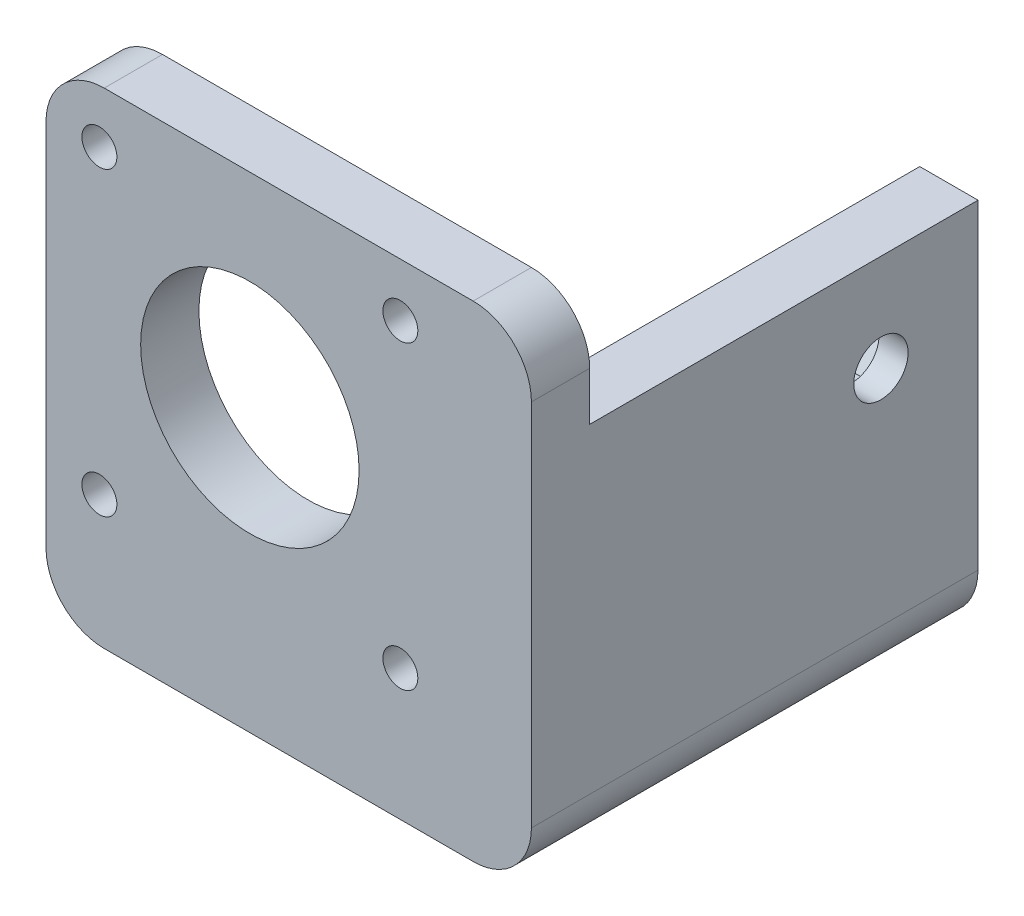
ISO-10303-21;
HEADER;
FILE_DESCRIPTION(('STEP AP214'),'2;1');
FILE_NAME('part.step','',(''),(''),'','','');
FILE_SCHEMA(('AUTOMOTIVE_DESIGN { 1 0 10303 214 1 1 1 1 }'));
ENDSEC;
DATA;
#1=APPLICATION_CONTEXT('core data for automotive mechanical design processes');
#2=APPLICATION_PROTOCOL_DEFINITION('international standard','automotive_design',2000,#1);
#3=PRODUCT_CONTEXT('',#1,'mechanical');
#4=PRODUCT('Part','Part','',(#3));
#5=PRODUCT_RELATED_PRODUCT_CATEGORY('part','',(#4));
#6=PRODUCT_DEFINITION_FORMATION('','',#4);
#7=PRODUCT_DEFINITION_CONTEXT('part definition',#1,'design');
#8=PRODUCT_DEFINITION('design','',#6,#7);
#9=PRODUCT_DEFINITION_SHAPE('','',#8);
#10=(LENGTH_UNIT() NAMED_UNIT(*) SI_UNIT(.MILLI.,.METRE.));
#11=(NAMED_UNIT(*) PLANE_ANGLE_UNIT() SI_UNIT($,.RADIAN.));
#12=(NAMED_UNIT(*) SI_UNIT($,.STERADIAN.) SOLID_ANGLE_UNIT());
#13=UNCERTAINTY_MEASURE_WITH_UNIT(LENGTH_MEASURE(1.E-05),#10,'distance_accuracy_value','');
#14=(GEOMETRIC_REPRESENTATION_CONTEXT(3) GLOBAL_UNCERTAINTY_ASSIGNED_CONTEXT((#13)) GLOBAL_UNIT_ASSIGNED_CONTEXT((#10,
#11,#12)) REPRESENTATION_CONTEXT('',''));
#15=CARTESIAN_POINT('',(0.,0.,0.));
#16=DIRECTION('',(0.,0.,1.));
#17=DIRECTION('',(1.,0.,0.));
#18=AXIS2_PLACEMENT_3D('',#15,#16,#17);
#19=CARTESIAN_POINT('',(0.,29.,-36.));
#20=DIRECTION('',(1.,0.,0.));
#21=DIRECTION('',(0.,0.,-1.));
#22=AXIS2_PLACEMENT_3D('',#19,#20,#21);
#23=CYLINDRICAL_SURFACE('',#22,2.79999999999999);
#24=CARTESIAN_POINT('',(0.,29.,-36.));
#25=DIRECTION('',(1.,0.,0.));
#26=DIRECTION('',(0.,0.,-1.));
#27=AXIS2_PLACEMENT_3D('',#24,#25,#26);
#28=CIRCLE('',#27,2.8);
#29=CARTESIAN_POINT('',(0.,29.,-38.8));
#30=VERTEX_POINT('',#29);
#31=EDGE_CURVE('E317',#30,#30,#28,.T.);
#32=ORIENTED_EDGE('',*,*,#31,.T.);
#33=EDGE_LOOP('',(#32));
#34=FACE_BOUND('',#33,.T.);
#35=CARTESIAN_POINT('',(-3.,29.,-36.));
#36=DIRECTION('',(-1.,0.,0.));
#37=DIRECTION('',(0.,0.,1.));
#38=AXIS2_PLACEMENT_3D('',#35,#36,#37);
#39=CIRCLE('',#38,2.79999999999999);
#40=CARTESIAN_POINT('',(-3.,29.,-33.2));
#41=VERTEX_POINT('',#40);
#42=EDGE_CURVE('E257',#41,#41,#39,.F.);
#43=ORIENTED_EDGE('',*,*,#42,.F.);
#44=EDGE_LOOP('',(#43));
#45=FACE_BOUND('',#44,.T.);
#46=ADVANCED_FACE('F37',(#34,#45),#23,.F.);
#47=CARTESIAN_POINT('',(-24.,0.,-15.));
#48=DIRECTION('',(0.,-1.,0.));
#49=DIRECTION('',(0.,0.,-1.));
#50=AXIS2_PLACEMENT_3D('',#47,#48,#49);
#51=CYLINDRICAL_SURFACE('',#50,2.79999999999999);
#52=CARTESIAN_POINT('',(-24.,0.,-15.));
#53=DIRECTION('',(0.,-1.,0.));
#54=DIRECTION('',(0.,0.,-1.));
#55=AXIS2_PLACEMENT_3D('',#52,#53,#54);
#56=CIRCLE('',#55,2.79999999999999);
#57=CARTESIAN_POINT('',(-24.,0.,-17.8));
#58=VERTEX_POINT('',#57);
#59=EDGE_CURVE('E314',#58,#58,#56,.T.);
#60=ORIENTED_EDGE('',*,*,#59,.T.);
#61=EDGE_LOOP('',(#60));
#62=FACE_BOUND('',#61,.T.);
#63=CARTESIAN_POINT('',(-24.,3.,-15.));
#64=DIRECTION('',(0.,1.,0.));
#65=DIRECTION('',(-1.,0.,0.));
#66=AXIS2_PLACEMENT_3D('',#63,#64,#65);
#67=CIRCLE('',#66,2.79999999999999);
#68=CARTESIAN_POINT('',(-26.8,3.,-15.));
#69=VERTEX_POINT('',#68);
#70=EDGE_CURVE('E303',#69,#69,#67,.F.);
#71=ORIENTED_EDGE('',*,*,#70,.F.);
#72=EDGE_LOOP('',(#71));
#73=FACE_BOUND('',#72,.T.);
#74=ADVANCED_FACE('F494',(#62,#73),#51,.F.);
#75=CARTESIAN_POINT('',(0.,0.,-6.));
#76=DIRECTION('',(0.,0.,1.));
#77=DIRECTION('',(1.,0.,0.));
#78=AXIS2_PLACEMENT_3D('',#75,#76,#77);
#79=PLANE('',#78);
#80=CARTESIAN_POINT('',(-29.,29.,-6.));
#81=DIRECTION('',(0.,0.,1.));
#82=DIRECTION('',(1.,0.,0.));
#83=AXIS2_PLACEMENT_3D('',#80,#81,#82);
#84=CIRCLE('',#83,11.25);
#85=CARTESIAN_POINT('',(-17.75,29.,-6.));
#86=VERTEX_POINT('',#85);
#87=EDGE_CURVE('E323',#86,#86,#84,.T.);
#88=ORIENTED_EDGE('',*,*,#87,.T.);
#89=EDGE_LOOP('',(#88));
#90=FACE_BOUND('',#89,.T.);
#91=CARTESIAN_POINT('',(-44.5,44.5,-6.));
#92=DIRECTION('',(0.,0.,1.));
#93=DIRECTION('',(1.,0.,0.));
#94=AXIS2_PLACEMENT_3D('',#91,#92,#93);
#95=CIRCLE('',#94,1.8);
#96=CARTESIAN_POINT('',(-42.7,44.5,-6.));
#97=VERTEX_POINT('',#96);
#98=EDGE_CURVE('E329',#97,#97,#95,.T.);
#99=ORIENTED_EDGE('',*,*,#98,.T.);
#100=EDGE_LOOP('',(#99));
#101=FACE_BOUND('',#100,.T.);
#102=CARTESIAN_POINT('',(-13.5,44.5,-6.));
#103=DIRECTION('',(0.,0.,1.));
#104=DIRECTION('',(1.,0.,0.));
#105=AXIS2_PLACEMENT_3D('',#102,#103,#104);
#106=CIRCLE('',#105,1.8);
#107=CARTESIAN_POINT('',(-11.7,44.5,-6.));
#108=VERTEX_POINT('',#107);
#109=EDGE_CURVE('E335',#108,#108,#106,.T.);
#110=ORIENTED_EDGE('',*,*,#109,.T.);
#111=EDGE_LOOP('',(#110));
#112=FACE_BOUND('',#111,.T.);
#113=CARTESIAN_POINT('',(-13.5,13.5,-6.));
#114=DIRECTION('',(0.,0.,1.));
#115=DIRECTION('',(1.,0.,0.));
#116=AXIS2_PLACEMENT_3D('',#113,#114,#115);
#117=CIRCLE('',#116,1.8);
#118=CARTESIAN_POINT('',(-11.7,13.5,-6.));
#119=VERTEX_POINT('',#118);
#120=EDGE_CURVE('E339',#119,#119,#117,.T.);
#121=ORIENTED_EDGE('',*,*,#120,.T.);
#122=EDGE_LOOP('',(#121));
#123=FACE_BOUND('',#122,.T.);
#124=CARTESIAN_POINT('',(-44.5,13.5,-6.));
#125=DIRECTION('',(0.,0.,1.));
#126=DIRECTION('',(1.,0.,0.));
#127=AXIS2_PLACEMENT_3D('',#124,#125,#126);
#128=CIRCLE('',#127,1.8);
#129=CARTESIAN_POINT('',(-42.7,13.5,-6.));
#130=VERTEX_POINT('',#129);
#131=EDGE_CURVE('E345',#130,#130,#128,.T.);
#132=ORIENTED_EDGE('',*,*,#131,.T.);
#133=EDGE_LOOP('',(#132));
#134=FACE_BOUND('',#133,.T.);
#135=DIRECTION('',(1.,0.,0.));
#136=VECTOR('',#135,1.);
#137=CARTESIAN_POINT('',(-50.,0.,-6.));
#138=LINE('',#137,#136);
#139=CARTESIAN_POINT('',(-44.,0.,-6.));
#140=VERTEX_POINT('',#139);
#141=CARTESIAN_POINT('',(-34.,0.,-6.));
#142=VERTEX_POINT('',#141);
#143=EDGE_CURVE('E389',#140,#142,#138,.T.);
#144=ORIENTED_EDGE('',*,*,#143,.F.);
#145=CARTESIAN_POINT('',(-44.,6.,-6.));
#146=DIRECTION('',(0.,0.,1.));
#147=DIRECTION('',(1.,0.,0.));
#148=AXIS2_PLACEMENT_3D('',#145,#146,#147);
#149=CIRCLE('',#148,6.);
#150=CARTESIAN_POINT('',(-50.,6.,-6.));
#151=VERTEX_POINT('',#150);
#152=EDGE_CURVE('E436',#140,#151,#149,.F.);
#153=ORIENTED_EDGE('',*,*,#152,.T.);
#154=DIRECTION('',(0.,-1.,0.));
#155=VECTOR('',#154,1.);
#156=CARTESIAN_POINT('',(-50.,50.,-6.));
#157=LINE('',#156,#155);
#158=CARTESIAN_POINT('',(-50.,44.,-6.));
#159=VERTEX_POINT('',#158);
#160=EDGE_CURVE('E386',#159,#151,#157,.T.);
#161=ORIENTED_EDGE('',*,*,#160,.F.);
#162=CARTESIAN_POINT('',(-44.,44.,-6.));
#163=DIRECTION('',(0.,0.,1.));
#164=DIRECTION('',(1.,0.,0.));
#165=AXIS2_PLACEMENT_3D('',#162,#163,#164);
#166=CIRCLE('',#165,6.);
#167=CARTESIAN_POINT('',(-44.,50.,-6.));
#168=VERTEX_POINT('',#167);
#169=EDGE_CURVE('E434',#159,#168,#166,.F.);
#170=ORIENTED_EDGE('',*,*,#169,.T.);
#171=DIRECTION('',(-1.,0.,0.));
#172=VECTOR('',#171,1.);
#173=CARTESIAN_POINT('',(-50.,50.,-6.));
#174=LINE('',#173,#172);
#175=CARTESIAN_POINT('',(-6.,50.,-6.));
#176=VERTEX_POINT('',#175);
#177=EDGE_CURVE('E394',#176,#168,#174,.T.);
#178=ORIENTED_EDGE('',*,*,#177,.F.);
#179=CARTESIAN_POINT('',(-6.,44.,-6.));
#180=DIRECTION('',(0.,0.,1.));
#181=DIRECTION('',(1.,0.,0.));
#182=AXIS2_PLACEMENT_3D('',#179,#180,#181);
#183=CIRCLE('',#182,6.);
#184=CARTESIAN_POINT('',(0.,44.,-6.));
#185=VERTEX_POINT('',#184);
#186=EDGE_CURVE('E59',#176,#185,#183,.F.);
#187=ORIENTED_EDGE('',*,*,#186,.T.);
#188=DIRECTION('',(0.,1.,0.));
#189=VECTOR('',#188,1.);
#190=CARTESIAN_POINT('',(0.,50.,-6.));
#191=LINE('',#190,#189);
#192=CARTESIAN_POINT('',(0.,39.,-6.));
#193=VERTEX_POINT('',#192);
#194=EDGE_CURVE('E392',#193,#185,#191,.T.);
#195=ORIENTED_EDGE('',*,*,#194,.F.);
#196=DIRECTION('',(1.,0.,0.));
#197=VECTOR('',#196,1.);
#198=CARTESIAN_POINT('',(0.,39.,-6.));
#199=LINE('',#198,#197);
#200=CARTESIAN_POINT('',(-6.,39.,-6.));
#201=VERTEX_POINT('',#200);
#202=EDGE_CURVE('E349',#201,#193,#199,.T.);
#203=ORIENTED_EDGE('',*,*,#202,.F.);
#204=DIRECTION('',(0.,1.,0.));
#205=VECTOR('',#204,1.);
#206=CARTESIAN_POINT('',(-6.,39.,-6.));
#207=LINE('',#206,#205);
#208=CARTESIAN_POINT('',(-6.,6.,-6.));
#209=VERTEX_POINT('',#208);
#210=EDGE_CURVE('E366',#209,#201,#207,.T.);
#211=ORIENTED_EDGE('',*,*,#210,.F.);
#212=DIRECTION('',(1.,0.,0.));
#213=VECTOR('',#212,1.);
#214=CARTESIAN_POINT('',(-6.,6.,-6.));
#215=LINE('',#214,#213);
#216=CARTESIAN_POINT('',(-34.,6.,-6.));
#217=VERTEX_POINT('',#216);
#218=EDGE_CURVE('E363',#217,#209,#215,.T.);
#219=ORIENTED_EDGE('',*,*,#218,.F.);
#220=DIRECTION('',(0.,1.,0.));
#221=VECTOR('',#220,1.);
#222=CARTESIAN_POINT('',(-34.,6.,-6.));
#223=LINE('',#222,#221);
#224=EDGE_CURVE('E360',#142,#217,#223,.T.);
#225=ORIENTED_EDGE('',*,*,#224,.F.);
#226=EDGE_LOOP('',(#144,#153,#161,#170,#178,#187,#195,#203,#211,#219,#225));
#227=FACE_BOUND('',#226,.T.);
#228=ADVANCED_FACE('F471',(#90,#101,#112,#123,#134,#227),#79,.F.);
#229=CARTESIAN_POINT('',(-50.,50.,-6.));
#230=DIRECTION('',(-1.,0.,0.));
#231=DIRECTION('',(0.,0.,1.));
#232=AXIS2_PLACEMENT_3D('',#229,#230,#231);
#233=PLANE('',#232);
#234=ORIENTED_EDGE('',*,*,#160,.T.);
#235=DIRECTION('',(0.,0.,1.));
#236=VECTOR('',#235,1.);
#237=CARTESIAN_POINT('',(-50.,6.,-6.));
#238=LINE('',#237,#236);
#239=CARTESIAN_POINT('',(-50.,6.,0.));
#240=VERTEX_POINT('',#239);
#241=EDGE_CURVE('E417',#151,#240,#238,.T.);
#242=ORIENTED_EDGE('',*,*,#241,.T.);
#243=DIRECTION('',(0.,-1.,0.));
#244=VECTOR('',#243,1.);
#245=CARTESIAN_POINT('',(-50.,50.,0.));
#246=LINE('',#245,#244);
#247=CARTESIAN_POINT('',(-50.,44.,0.));
#248=VERTEX_POINT('',#247);
#249=EDGE_CURVE('E385',#248,#240,#246,.T.);
#250=ORIENTED_EDGE('',*,*,#249,.F.);
#251=DIRECTION('',(0.,0.,1.));
#252=VECTOR('',#251,1.);
#253=CARTESIAN_POINT('',(-50.,44.,-6.));
#254=LINE('',#253,#252);
#255=EDGE_CURVE('E397',#248,#159,#254,.F.);
#256=ORIENTED_EDGE('',*,*,#255,.T.);
#257=EDGE_LOOP('',(#234,#242,#250,#256));
#258=FACE_BOUND('',#257,.T.);
#259=ADVANCED_FACE('F677',(#258),#233,.T.);
#260=CARTESIAN_POINT('',(-50.,50.,-6.));
#261=DIRECTION('',(0.,1.,0.));
#262=DIRECTION('',(0.,0.,1.));
#263=AXIS2_PLACEMENT_3D('',#260,#261,#262);
#264=PLANE('',#263);
#265=ORIENTED_EDGE('',*,*,#177,.T.);
#266=DIRECTION('',(0.,0.,1.));
#267=VECTOR('',#266,1.);
#268=CARTESIAN_POINT('',(-44.,50.,-6.));
#269=LINE('',#268,#267);
#270=CARTESIAN_POINT('',(-44.,50.,0.));
#271=VERTEX_POINT('',#270);
#272=EDGE_CURVE('E440',#168,#271,#269,.T.);
#273=ORIENTED_EDGE('',*,*,#272,.T.);
#274=DIRECTION('',(-1.,0.,0.));
#275=VECTOR('',#274,1.);
#276=CARTESIAN_POINT('',(-50.,50.,0.));
#277=LINE('',#276,#275);
#278=CARTESIAN_POINT('',(-6.,50.,0.));
#279=VERTEX_POINT('',#278);
#280=EDGE_CURVE('E390',#279,#271,#277,.T.);
#281=ORIENTED_EDGE('',*,*,#280,.F.);
#282=DIRECTION('',(0.,0.,1.));
#283=VECTOR('',#282,1.);
#284=CARTESIAN_POINT('',(-6.,50.,-6.));
#285=LINE('',#284,#283);
#286=EDGE_CURVE('E438',#279,#176,#285,.F.);
#287=ORIENTED_EDGE('',*,*,#286,.T.);
#288=EDGE_LOOP('',(#265,#273,#281,#287));
#289=FACE_BOUND('',#288,.T.);
#290=ADVANCED_FACE('F688',(#289),#264,.T.);
#291=CARTESIAN_POINT('',(0.,50.,-6.));
#292=DIRECTION('',(1.,0.,0.));
#293=DIRECTION('',(0.,0.,-1.));
#294=AXIS2_PLACEMENT_3D('',#291,#292,#293);
#295=PLANE('',#294);
#296=ORIENTED_EDGE('',*,*,#31,.F.);
#297=EDGE_LOOP('',(#296));
#298=FACE_BOUND('',#297,.T.);
#299=DIRECTION('',(0.,1.,0.));
#300=VECTOR('',#299,1.);
#301=CARTESIAN_POINT('',(0.,50.,0.));
#302=LINE('',#301,#300);
#303=CARTESIAN_POINT('',(0.,6.,0.));
#304=VERTEX_POINT('',#303);
#305=CARTESIAN_POINT('',(0.,44.,0.));
#306=VERTEX_POINT('',#305);
#307=EDGE_CURVE('E403',#304,#306,#302,.T.);
#308=ORIENTED_EDGE('',*,*,#307,.F.);
#309=DIRECTION('',(0.,0.,1.));
#310=VECTOR('',#309,1.);
#311=CARTESIAN_POINT('',(0.,6.,-6.));
#312=LINE('',#311,#310);
#313=CARTESIAN_POINT('',(0.,6.,-46.));
#314=VERTEX_POINT('',#313);
#315=EDGE_CURVE('E45',#304,#314,#312,.F.);
#316=ORIENTED_EDGE('',*,*,#315,.T.);
#317=DIRECTION('',(0.,-1.,0.));
#318=VECTOR('',#317,1.);
#319=CARTESIAN_POINT('',(0.,39.,-46.));
#320=LINE('',#319,#318);
#321=CARTESIAN_POINT('',(0.,39.,-46.));
#322=VERTEX_POINT('',#321);
#323=EDGE_CURVE('E346',#322,#314,#320,.T.);
#324=ORIENTED_EDGE('',*,*,#323,.F.);
#325=DIRECTION('',(0.,0.,1.));
#326=VECTOR('',#325,1.);
#327=CARTESIAN_POINT('',(0.,39.,-46.));
#328=LINE('',#327,#326);
#329=EDGE_CURVE('E359',#322,#193,#328,.T.);
#330=ORIENTED_EDGE('',*,*,#329,.T.);
#331=ORIENTED_EDGE('',*,*,#194,.T.);
#332=DIRECTION('',(0.,0.,1.));
#333=VECTOR('',#332,1.);
#334=CARTESIAN_POINT('',(0.,44.,-6.));
#335=LINE('',#334,#333);
#336=EDGE_CURVE('E443',#185,#306,#335,.T.);
#337=ORIENTED_EDGE('',*,*,#336,.T.);
#338=EDGE_LOOP('',(#308,#316,#324,#330,#331,#337));
#339=FACE_BOUND('',#338,.T.);
#340=ADVANCED_FACE('F446',(#298,#339),#295,.T.);
#341=CARTESIAN_POINT('',(-50.,0.,-6.));
#342=DIRECTION('',(0.,-1.,0.));
#343=DIRECTION('',(0.,0.,-1.));
#344=AXIS2_PLACEMENT_3D('',#341,#342,#343);
#345=PLANE('',#344);
#346=ORIENTED_EDGE('',*,*,#59,.F.);
#347=EDGE_LOOP('',(#346));
#348=FACE_BOUND('',#347,.T.);
#349=DIRECTION('',(1.,0.,0.));
#350=VECTOR('',#349,1.);
#351=CARTESIAN_POINT('',(-50.,0.,0.));
#352=LINE('',#351,#350);
#353=CARTESIAN_POINT('',(-44.,0.,0.));
#354=VERTEX_POINT('',#353);
#355=CARTESIAN_POINT('',(-6.,0.,0.));
#356=VERTEX_POINT('',#355);
#357=EDGE_CURVE('E400',#354,#356,#352,.T.);
#358=ORIENTED_EDGE('',*,*,#357,.F.);
#359=DIRECTION('',(0.,0.,1.));
#360=VECTOR('',#359,1.);
#361=CARTESIAN_POINT('',(-44.,0.,-6.));
#362=LINE('',#361,#360);
#363=EDGE_CURVE('E431',#354,#140,#362,.F.);
#364=ORIENTED_EDGE('',*,*,#363,.T.);
#365=ORIENTED_EDGE('',*,*,#143,.T.);
#366=DIRECTION('',(0.,0.,1.));
#367=VECTOR('',#366,1.);
#368=CARTESIAN_POINT('',(-34.,0.,-46.));
#369=LINE('',#368,#367);
#370=CARTESIAN_POINT('',(-34.,0.,-46.));
#371=VERTEX_POINT('',#370);
#372=EDGE_CURVE('E382',#371,#142,#369,.T.);
#373=ORIENTED_EDGE('',*,*,#372,.F.);
#374=DIRECTION('',(-1.,0.,0.));
#375=VECTOR('',#374,1.);
#376=CARTESIAN_POINT('',(0.,0.,-46.));
#377=LINE('',#376,#375);
#378=CARTESIAN_POINT('',(-6.,0.,-46.));
#379=VERTEX_POINT('',#378);
#380=EDGE_CURVE('E348',#379,#371,#377,.T.);
#381=ORIENTED_EDGE('',*,*,#380,.F.);
#382=DIRECTION('',(0.,0.,1.));
#383=VECTOR('',#382,1.);
#384=CARTESIAN_POINT('',(-6.,0.,-6.));
#385=LINE('',#384,#383);
#386=EDGE_CURVE('E428',#379,#356,#385,.T.);
#387=ORIENTED_EDGE('',*,*,#386,.T.);
#388=EDGE_LOOP('',(#358,#364,#365,#373,#381,#387));
#389=FACE_BOUND('',#388,.T.);
#390=ADVANCED_FACE('F458',(#348,#389),#345,.T.);
#391=CARTESIAN_POINT('',(0.,0.,0.));
#392=DIRECTION('',(0.,0.,1.));
#393=DIRECTION('',(1.,0.,0.));
#394=AXIS2_PLACEMENT_3D('',#391,#392,#393);
#395=PLANE('',#394);
#396=CARTESIAN_POINT('',(-29.,29.,0.));
#397=DIRECTION('',(0.,0.,1.));
#398=DIRECTION('',(1.,0.,0.));
#399=AXIS2_PLACEMENT_3D('',#396,#397,#398);
#400=CIRCLE('',#399,11.25);
#401=CARTESIAN_POINT('',(-17.75,29.,0.));
#402=VERTEX_POINT('',#401);
#403=EDGE_CURVE('E320',#402,#402,#400,.T.);
#404=ORIENTED_EDGE('',*,*,#403,.F.);
#405=EDGE_LOOP('',(#404));
#406=FACE_BOUND('',#405,.T.);
#407=CARTESIAN_POINT('',(-44.5,44.5,0.));
#408=DIRECTION('',(0.,0.,1.));
#409=DIRECTION('',(1.,0.,0.));
#410=AXIS2_PLACEMENT_3D('',#407,#408,#409);
#411=CIRCLE('',#410,1.8);
#412=CARTESIAN_POINT('',(-42.7,44.5,0.));
#413=VERTEX_POINT('',#412);
#414=EDGE_CURVE('E326',#413,#413,#411,.T.);
#415=ORIENTED_EDGE('',*,*,#414,.F.);
#416=EDGE_LOOP('',(#415));
#417=FACE_BOUND('',#416,.T.);
#418=CARTESIAN_POINT('',(-13.5,44.5,0.));
#419=DIRECTION('',(0.,0.,1.));
#420=DIRECTION('',(1.,0.,0.));
#421=AXIS2_PLACEMENT_3D('',#418,#419,#420);
#422=CIRCLE('',#421,1.8);
#423=CARTESIAN_POINT('',(-11.7,44.5,0.));
#424=VERTEX_POINT('',#423);
#425=EDGE_CURVE('E332',#424,#424,#422,.T.);
#426=ORIENTED_EDGE('',*,*,#425,.F.);
#427=EDGE_LOOP('',(#426));
#428=FACE_BOUND('',#427,.T.);
#429=CARTESIAN_POINT('',(-13.5,13.5,0.));
#430=DIRECTION('',(0.,0.,1.));
#431=DIRECTION('',(1.,0.,0.));
#432=AXIS2_PLACEMENT_3D('',#429,#430,#431);
#433=CIRCLE('',#432,1.8);
#434=CARTESIAN_POINT('',(-11.7,13.5,0.));
#435=VERTEX_POINT('',#434);
#436=EDGE_CURVE('E336',#435,#435,#433,.T.);
#437=ORIENTED_EDGE('',*,*,#436,.F.);
#438=EDGE_LOOP('',(#437));
#439=FACE_BOUND('',#438,.T.);
#440=CARTESIAN_POINT('',(-44.5,13.5,0.));
#441=DIRECTION('',(0.,0.,1.));
#442=DIRECTION('',(1.,0.,0.));
#443=AXIS2_PLACEMENT_3D('',#440,#441,#442);
#444=CIRCLE('',#443,1.8);
#445=CARTESIAN_POINT('',(-42.7,13.5,0.));
#446=VERTEX_POINT('',#445);
#447=EDGE_CURVE('E342',#446,#446,#444,.T.);
#448=ORIENTED_EDGE('',*,*,#447,.F.);
#449=EDGE_LOOP('',(#448));
#450=FACE_BOUND('',#449,.T.);
#451=ORIENTED_EDGE('',*,*,#249,.T.);
#452=CARTESIAN_POINT('',(-44.,6.,0.));
#453=DIRECTION('',(0.,0.,1.));
#454=DIRECTION('',(1.,0.,0.));
#455=AXIS2_PLACEMENT_3D('',#452,#453,#454);
#456=CIRCLE('',#455,6.);
#457=EDGE_CURVE('E426',#240,#354,#456,.T.);
#458=ORIENTED_EDGE('',*,*,#457,.T.);
#459=ORIENTED_EDGE('',*,*,#357,.T.);
#460=CARTESIAN_POINT('',(-6.,6.,0.));
#461=DIRECTION('',(0.,0.,1.));
#462=DIRECTION('',(1.,0.,0.));
#463=AXIS2_PLACEMENT_3D('',#460,#461,#462);
#464=CIRCLE('',#463,6.);
#465=EDGE_CURVE('E422',#356,#304,#464,.T.);
#466=ORIENTED_EDGE('',*,*,#465,.T.);
#467=ORIENTED_EDGE('',*,*,#307,.T.);
#468=CARTESIAN_POINT('',(-6.,44.,0.));
#469=DIRECTION('',(0.,0.,1.));
#470=DIRECTION('',(1.,0.,0.));
#471=AXIS2_PLACEMENT_3D('',#468,#469,#470);
#472=CIRCLE('',#471,6.);
#473=EDGE_CURVE('E420',#306,#279,#472,.T.);
#474=ORIENTED_EDGE('',*,*,#473,.T.);
#475=ORIENTED_EDGE('',*,*,#280,.T.);
#476=CARTESIAN_POINT('',(-44.,44.,0.));
#477=DIRECTION('',(0.,0.,1.));
#478=DIRECTION('',(1.,0.,0.));
#479=AXIS2_PLACEMENT_3D('',#476,#477,#478);
#480=CIRCLE('',#479,6.);
#481=EDGE_CURVE('E424',#271,#248,#480,.T.);
#482=ORIENTED_EDGE('',*,*,#481,.T.);
#483=EDGE_LOOP('',(#451,#458,#459,#466,#467,#474,#475,#482));
#484=FACE_BOUND('',#483,.T.);
#485=ADVANCED_FACE('F449',(#406,#417,#428,#439,#450,#484),#395,.T.);
#486=CARTESIAN_POINT('',(-34.,6.,-46.));
#487=DIRECTION('',(1.,0.,0.));
#488=DIRECTION('',(0.,0.,-1.));
#489=AXIS2_PLACEMENT_3D('',#486,#487,#488);
#490=PLANE('',#489);
#491=ORIENTED_EDGE('',*,*,#224,.T.);
#492=DIRECTION('',(0.,0.,1.));
#493=VECTOR('',#492,1.);
#494=CARTESIAN_POINT('',(-34.,6.,-46.));
#495=LINE('',#494,#493);
#496=CARTESIAN_POINT('',(-34.,6.,-46.));
#497=VERTEX_POINT('',#496);
#498=EDGE_CURVE('E379',#497,#217,#495,.T.);
#499=ORIENTED_EDGE('',*,*,#498,.F.);
#500=DIRECTION('',(0.,1.,0.));
#501=VECTOR('',#500,1.);
#502=CARTESIAN_POINT('',(-34.,6.,-46.));
#503=LINE('',#502,#501);
#504=EDGE_CURVE('E351',#371,#497,#503,.T.);
#505=ORIENTED_EDGE('',*,*,#504,.F.);
#506=ORIENTED_EDGE('',*,*,#372,.T.);
#507=EDGE_LOOP('',(#491,#499,#505,#506));
#508=FACE_BOUND('',#507,.T.);
#509=ADVANCED_FACE('F481',(#508),#490,.F.);
#510=CARTESIAN_POINT('',(-6.,6.,-46.));
#511=DIRECTION('',(0.,-1.,0.));
#512=DIRECTION('',(1.,0.,0.));
#513=AXIS2_PLACEMENT_3D('',#510,#511,#512);
#514=PLANE('',#513);
#515=DIRECTION('',(0.866025403784439,0.,0.499999999999999));
#516=VECTOR('',#515,1.);
#517=CARTESIAN_POINT('',(-28.2,6.,-12.5751288694036));
#518=LINE('',#517,#516);
#519=CARTESIAN_POINT('',(-28.2,6.,-12.5751288694036));
#520=VERTEX_POINT('',#519);
#521=CARTESIAN_POINT('',(-24.,6.,-10.1502577388071));
#522=VERTEX_POINT('',#521);
#523=EDGE_CURVE('E287',#520,#522,#518,.T.);
#524=ORIENTED_EDGE('',*,*,#523,.F.);
#525=DIRECTION('',(0.,0.,1.));
#526=VECTOR('',#525,1.);
#527=CARTESIAN_POINT('',(-28.2,6.,-17.4248711305964));
#528=LINE('',#527,#526);
#529=CARTESIAN_POINT('',(-28.2,6.,-17.4248711305964));
#530=VERTEX_POINT('',#529);
#531=EDGE_CURVE('E285',#530,#520,#528,.T.);
#532=ORIENTED_EDGE('',*,*,#531,.F.);
#533=DIRECTION('',(-0.866025403784439,0.,0.499999999999999));
#534=VECTOR('',#533,1.);
#535=CARTESIAN_POINT('',(-24.,6.,-19.8497422611929));
#536=LINE('',#535,#534);
#537=CARTESIAN_POINT('',(-24.,6.,-19.8497422611929));
#538=VERTEX_POINT('',#537);
#539=EDGE_CURVE('E269',#538,#530,#536,.T.);
#540=ORIENTED_EDGE('',*,*,#539,.F.);
#541=DIRECTION('',(-0.866025403784438,0.,-0.500000000000001));
#542=VECTOR('',#541,1.);
#543=CARTESIAN_POINT('',(-19.8,6.,-17.4248711305964));
#544=LINE('',#543,#542);
#545=CARTESIAN_POINT('',(-19.8,6.,-17.4248711305964));
#546=VERTEX_POINT('',#545);
#547=EDGE_CURVE('E296',#546,#538,#544,.T.);
#548=ORIENTED_EDGE('',*,*,#547,.F.);
#549=DIRECTION('',(0.,0.,-1.));
#550=VECTOR('',#549,1.);
#551=CARTESIAN_POINT('',(-19.8,6.,-12.5751288694036));
#552=LINE('',#551,#550);
#553=CARTESIAN_POINT('',(-19.8,6.,-12.5751288694036));
#554=VERTEX_POINT('',#553);
#555=EDGE_CURVE('E293',#554,#546,#552,.T.);
#556=ORIENTED_EDGE('',*,*,#555,.F.);
#557=DIRECTION('',(0.866025403784438,0.,-0.500000000000001));
#558=VECTOR('',#557,1.);
#559=CARTESIAN_POINT('',(-24.,6.,-10.1502577388071));
#560=LINE('',#559,#558);
#561=EDGE_CURVE('E290',#522,#554,#560,.T.);
#562=ORIENTED_EDGE('',*,*,#561,.F.);
#563=EDGE_LOOP('',(#524,#532,#540,#548,#556,#562));
#564=FACE_BOUND('',#563,.T.);
#565=ORIENTED_EDGE('',*,*,#218,.T.);
#566=DIRECTION('',(0.,0.,1.));
#567=VECTOR('',#566,1.);
#568=CARTESIAN_POINT('',(-6.,6.,-46.));
#569=LINE('',#568,#567);
#570=CARTESIAN_POINT('',(-6.,6.,-46.));
#571=VERTEX_POINT('',#570);
#572=EDGE_CURVE('E376',#571,#209,#569,.T.);
#573=ORIENTED_EDGE('',*,*,#572,.F.);
#574=DIRECTION('',(1.,0.,0.));
#575=VECTOR('',#574,1.);
#576=CARTESIAN_POINT('',(-6.,6.,-46.));
#577=LINE('',#576,#575);
#578=EDGE_CURVE('E353',#497,#571,#577,.T.);
#579=ORIENTED_EDGE('',*,*,#578,.F.);
#580=ORIENTED_EDGE('',*,*,#498,.T.);
#581=EDGE_LOOP('',(#565,#573,#579,#580));
#582=FACE_BOUND('',#581,.T.);
#583=ADVANCED_FACE('F478',(#564,#582),#514,.F.);
#584=CARTESIAN_POINT('',(-6.,39.,-46.));
#585=DIRECTION('',(1.,0.,0.));
#586=DIRECTION('',(0.,1.,0.));
#587=AXIS2_PLACEMENT_3D('',#584,#585,#586);
#588=PLANE('',#587);
#589=DIRECTION('',(0.,-0.866025403784438,0.5));
#590=VECTOR('',#589,1.);
#591=CARTESIAN_POINT('',(-6.,29.,-40.8497422611928));
#592=LINE('',#591,#590);
#593=CARTESIAN_POINT('',(-6.,29.,-40.8497422611928));
#594=VERTEX_POINT('',#593);
#595=CARTESIAN_POINT('',(-6.,24.8,-38.4248711305964));
#596=VERTEX_POINT('',#595);
#597=EDGE_CURVE('E245',#594,#596,#592,.T.);
#598=ORIENTED_EDGE('',*,*,#597,.F.);
#599=DIRECTION('',(0.,-0.86602540378444,-0.499999999999998));
#600=VECTOR('',#599,1.);
#601=CARTESIAN_POINT('',(-6.,33.2,-38.4248711305964));
#602=LINE('',#601,#600);
#603=CARTESIAN_POINT('',(-6.,33.2,-38.4248711305964));
#604=VERTEX_POINT('',#603);
#605=EDGE_CURVE('E212',#604,#594,#602,.T.);
#606=ORIENTED_EDGE('',*,*,#605,.F.);
#607=DIRECTION('',(0.,0.,-1.));
#608=VECTOR('',#607,1.);
#609=CARTESIAN_POINT('',(-6.,33.2,-33.5751288694036));
#610=LINE('',#609,#608);
#611=CARTESIAN_POINT('',(-6.,33.2,-33.5751288694036));
#612=VERTEX_POINT('',#611);
#613=EDGE_CURVE('E231',#612,#604,#610,.T.);
#614=ORIENTED_EDGE('',*,*,#613,.F.);
#615=DIRECTION('',(0.,0.866025403784438,-0.500000000000001));
#616=VECTOR('',#615,1.);
#617=CARTESIAN_POINT('',(-6.,29.,-31.1502577388071));
#618=LINE('',#617,#616);
#619=CARTESIAN_POINT('',(-6.,29.,-31.1502577388071));
#620=VERTEX_POINT('',#619);
#621=EDGE_CURVE('E234',#620,#612,#618,.T.);
#622=ORIENTED_EDGE('',*,*,#621,.F.);
#623=DIRECTION('',(0.,0.866025403784439,0.5));
#624=VECTOR('',#623,1.);
#625=CARTESIAN_POINT('',(-6.,24.8,-33.5751288694036));
#626=LINE('',#625,#624);
#627=CARTESIAN_POINT('',(-6.,24.8,-33.5751288694036));
#628=VERTEX_POINT('',#627);
#629=EDGE_CURVE('E250',#628,#620,#626,.T.);
#630=ORIENTED_EDGE('',*,*,#629,.F.);
#631=DIRECTION('',(0.,0.,1.));
#632=VECTOR('',#631,1.);
#633=CARTESIAN_POINT('',(-6.,24.8,-38.4248711305964));
#634=LINE('',#633,#632);
#635=EDGE_CURVE('E247',#596,#628,#634,.T.);
#636=ORIENTED_EDGE('',*,*,#635,.F.);
#637=EDGE_LOOP('',(#598,#606,#614,#622,#630,#636));
#638=FACE_BOUND('',#637,.T.);
#639=ORIENTED_EDGE('',*,*,#210,.T.);
#640=DIRECTION('',(0.,0.,1.));
#641=VECTOR('',#640,1.);
#642=CARTESIAN_POINT('',(-6.,39.,-46.));
#643=LINE('',#642,#641);
#644=CARTESIAN_POINT('',(-6.,39.,-46.));
#645=VERTEX_POINT('',#644);
#646=EDGE_CURVE('E373',#645,#201,#643,.T.);
#647=ORIENTED_EDGE('',*,*,#646,.F.);
#648=DIRECTION('',(0.,1.,0.));
#649=VECTOR('',#648,1.);
#650=CARTESIAN_POINT('',(-6.,39.,-46.));
#651=LINE('',#650,#649);
#652=EDGE_CURVE('E355',#571,#645,#651,.T.);
#653=ORIENTED_EDGE('',*,*,#652,.F.);
#654=ORIENTED_EDGE('',*,*,#572,.T.);
#655=EDGE_LOOP('',(#639,#647,#653,#654));
#656=FACE_BOUND('',#655,.T.);
#657=ADVANCED_FACE('F473',(#638,#656),#588,.F.);
#658=CARTESIAN_POINT('',(0.,39.,-46.));
#659=DIRECTION('',(0.,-1.,0.));
#660=DIRECTION('',(0.,0.,-1.));
#661=AXIS2_PLACEMENT_3D('',#658,#659,#660);
#662=PLANE('',#661);
#663=ORIENTED_EDGE('',*,*,#202,.T.);
#664=ORIENTED_EDGE('',*,*,#329,.F.);
#665=DIRECTION('',(1.,0.,0.));
#666=VECTOR('',#665,1.);
#667=CARTESIAN_POINT('',(0.,39.,-46.));
#668=LINE('',#667,#666);
#669=EDGE_CURVE('E357',#645,#322,#668,.T.);
#670=ORIENTED_EDGE('',*,*,#669,.F.);
#671=ORIENTED_EDGE('',*,*,#646,.T.);
#672=EDGE_LOOP('',(#663,#664,#670,#671));
#673=FACE_BOUND('',#672,.T.);
#674=ADVANCED_FACE('F468',(#673),#662,.F.);
#675=CARTESIAN_POINT('',(0.,0.,-46.));
#676=DIRECTION('',(0.,0.,-1.));
#677=DIRECTION('',(-1.,0.,0.));
#678=AXIS2_PLACEMENT_3D('',#675,#676,#677);
#679=PLANE('',#678);
#680=ORIENTED_EDGE('',*,*,#323,.T.);
#681=CARTESIAN_POINT('',(-6.,6.,-46.));
#682=DIRECTION('',(0.,0.,-1.));
#683=DIRECTION('',(-1.,0.,0.));
#684=AXIS2_PLACEMENT_3D('',#681,#682,#683);
#685=CIRCLE('',#684,6.);
#686=EDGE_CURVE('E11',#314,#379,#685,.T.);
#687=ORIENTED_EDGE('',*,*,#686,.T.);
#688=ORIENTED_EDGE('',*,*,#380,.T.);
#689=ORIENTED_EDGE('',*,*,#504,.T.);
#690=ORIENTED_EDGE('',*,*,#578,.T.);
#691=ORIENTED_EDGE('',*,*,#652,.T.);
#692=ORIENTED_EDGE('',*,*,#669,.T.);
#693=EDGE_LOOP('',(#680,#687,#688,#689,#690,#691,#692));
#694=FACE_BOUND('',#693,.T.);
#695=ADVANCED_FACE('F463',(#694),#679,.T.);
#696=CARTESIAN_POINT('',(-44.5,13.5,0.));
#697=DIRECTION('',(0.,0.,1.));
#698=DIRECTION('',(1.,0.,0.));
#699=AXIS2_PLACEMENT_3D('',#696,#697,#698);
#700=CYLINDRICAL_SURFACE('',#699,1.8);
#701=ORIENTED_EDGE('',*,*,#447,.T.);
#702=EDGE_LOOP('',(#701));
#703=FACE_BOUND('',#702,.T.);
#704=ORIENTED_EDGE('',*,*,#131,.F.);
#705=EDGE_LOOP('',(#704));
#706=FACE_BOUND('',#705,.T.);
#707=ADVANCED_FACE('F521',(#703,#706),#700,.F.);
#708=CARTESIAN_POINT('',(-13.5,13.5,0.));
#709=DIRECTION('',(0.,0.,1.));
#710=DIRECTION('',(1.,0.,0.));
#711=AXIS2_PLACEMENT_3D('',#708,#709,#710);
#712=CYLINDRICAL_SURFACE('',#711,1.8);
#713=ORIENTED_EDGE('',*,*,#436,.T.);
#714=EDGE_LOOP('',(#713));
#715=FACE_BOUND('',#714,.T.);
#716=ORIENTED_EDGE('',*,*,#120,.F.);
#717=EDGE_LOOP('',(#716));
#718=FACE_BOUND('',#717,.T.);
#719=ADVANCED_FACE('F517',(#715,#718),#712,.F.);
#720=CARTESIAN_POINT('',(-13.5,44.5,0.));
#721=DIRECTION('',(0.,0.,1.));
#722=DIRECTION('',(1.,0.,0.));
#723=AXIS2_PLACEMENT_3D('',#720,#721,#722);
#724=CYLINDRICAL_SURFACE('',#723,1.8);
#725=ORIENTED_EDGE('',*,*,#425,.T.);
#726=EDGE_LOOP('',(#725));
#727=FACE_BOUND('',#726,.T.);
#728=ORIENTED_EDGE('',*,*,#109,.F.);
#729=EDGE_LOOP('',(#728));
#730=FACE_BOUND('',#729,.T.);
#731=ADVANCED_FACE('F513',(#727,#730),#724,.F.);
#732=CARTESIAN_POINT('',(-44.5,44.5,0.));
#733=DIRECTION('',(0.,0.,1.));
#734=DIRECTION('',(1.,0.,0.));
#735=AXIS2_PLACEMENT_3D('',#732,#733,#734);
#736=CYLINDRICAL_SURFACE('',#735,1.8);
#737=ORIENTED_EDGE('',*,*,#414,.T.);
#738=EDGE_LOOP('',(#737));
#739=FACE_BOUND('',#738,.T.);
#740=ORIENTED_EDGE('',*,*,#98,.F.);
#741=EDGE_LOOP('',(#740));
#742=FACE_BOUND('',#741,.T.);
#743=ADVANCED_FACE('F509',(#739,#742),#736,.F.);
#744=CARTESIAN_POINT('',(-29.,29.,0.));
#745=DIRECTION('',(0.,0.,1.));
#746=DIRECTION('',(1.,0.,0.));
#747=AXIS2_PLACEMENT_3D('',#744,#745,#746);
#748=CYLINDRICAL_SURFACE('',#747,11.25);
#749=ORIENTED_EDGE('',*,*,#403,.T.);
#750=EDGE_LOOP('',(#749));
#751=FACE_BOUND('',#750,.T.);
#752=ORIENTED_EDGE('',*,*,#87,.F.);
#753=EDGE_LOOP('',(#752));
#754=FACE_BOUND('',#753,.T.);
#755=ADVANCED_FACE('F505',(#751,#754),#748,.F.);
#756=CARTESIAN_POINT('',(0.,3.00000000000001,0.));
#757=DIRECTION('',(0.,1.,0.));
#758=DIRECTION('',(-1.,0.,0.));
#759=AXIS2_PLACEMENT_3D('',#756,#757,#758);
#760=PLANE('',#759);
#761=DIRECTION('',(0.,0.,1.));
#762=VECTOR('',#761,1.);
#763=CARTESIAN_POINT('',(-28.2,3.,-17.4248711305964));
#764=LINE('',#763,#762);
#765=CARTESIAN_POINT('',(-28.2,3.,-17.4248711305964));
#766=VERTEX_POINT('',#765);
#767=CARTESIAN_POINT('',(-28.2,3.,-12.5751288694036));
#768=VERTEX_POINT('',#767);
#769=EDGE_CURVE('E265',#766,#768,#764,.T.);
#770=ORIENTED_EDGE('',*,*,#769,.T.);
#771=DIRECTION('',(0.866025403784439,0.,0.499999999999999));
#772=VECTOR('',#771,1.);
#773=CARTESIAN_POINT('',(-28.2,3.,-12.5751288694036));
#774=LINE('',#773,#772);
#775=CARTESIAN_POINT('',(-24.,3.,-10.1502577388071));
#776=VERTEX_POINT('',#775);
#777=EDGE_CURVE('E268',#768,#776,#774,.T.);
#778=ORIENTED_EDGE('',*,*,#777,.T.);
#779=DIRECTION('',(0.866025403784438,0.,-0.500000000000001));
#780=VECTOR('',#779,1.);
#781=CARTESIAN_POINT('',(-24.,3.,-10.1502577388071));
#782=LINE('',#781,#780);
#783=CARTESIAN_POINT('',(-19.8,3.,-12.5751288694036));
#784=VERTEX_POINT('',#783);
#785=EDGE_CURVE('E272',#776,#784,#782,.T.);
#786=ORIENTED_EDGE('',*,*,#785,.T.);
#787=DIRECTION('',(0.,0.,-1.));
#788=VECTOR('',#787,1.);
#789=CARTESIAN_POINT('',(-19.8,3.,-12.5751288694036));
#790=LINE('',#789,#788);
#791=CARTESIAN_POINT('',(-19.8,3.,-17.4248711305964));
#792=VERTEX_POINT('',#791);
#793=EDGE_CURVE('E275',#784,#792,#790,.T.);
#794=ORIENTED_EDGE('',*,*,#793,.T.);
#795=DIRECTION('',(-0.866025403784438,0.,-0.500000000000001));
#796=VECTOR('',#795,1.);
#797=CARTESIAN_POINT('',(-19.8,3.,-17.4248711305964));
#798=LINE('',#797,#796);
#799=CARTESIAN_POINT('',(-24.,3.,-19.8497422611929));
#800=VERTEX_POINT('',#799);
#801=EDGE_CURVE('E278',#792,#800,#798,.T.);
#802=ORIENTED_EDGE('',*,*,#801,.T.);
#803=DIRECTION('',(-0.866025403784439,0.,0.499999999999999));
#804=VECTOR('',#803,1.);
#805=CARTESIAN_POINT('',(-24.,3.,-19.8497422611929));
#806=LINE('',#805,#804);
#807=EDGE_CURVE('E281',#800,#766,#806,.T.);
#808=ORIENTED_EDGE('',*,*,#807,.T.);
#809=EDGE_LOOP('',(#770,#778,#786,#794,#802,#808));
#810=FACE_BOUND('',#809,.T.);
#811=ORIENTED_EDGE('',*,*,#70,.T.);
#812=EDGE_LOOP('',(#811));
#813=FACE_BOUND('',#812,.T.);
#814=ADVANCED_FACE('F508',(#810,#813),#760,.T.);
#815=CARTESIAN_POINT('',(-28.2,3.,-17.4248711305964));
#816=DIRECTION('',(-1.,0.,0.));
#817=DIRECTION('',(0.,-1.,0.));
#818=AXIS2_PLACEMENT_3D('',#815,#816,#817);
#819=PLANE('',#818);
#820=ORIENTED_EDGE('',*,*,#531,.T.);
#821=DIRECTION('',(0.,1.,0.));
#822=VECTOR('',#821,1.);
#823=CARTESIAN_POINT('',(-28.2,3.,-12.5751288694036));
#824=LINE('',#823,#822);
#825=EDGE_CURVE('E284',#768,#520,#824,.T.);
#826=ORIENTED_EDGE('',*,*,#825,.F.);
#827=ORIENTED_EDGE('',*,*,#769,.F.);
#828=DIRECTION('',(0.,1.,0.));
#829=VECTOR('',#828,1.);
#830=CARTESIAN_POINT('',(-28.2,3.,-17.4248711305964));
#831=LINE('',#830,#829);
#832=EDGE_CURVE('E301',#766,#530,#831,.T.);
#833=ORIENTED_EDGE('',*,*,#832,.T.);
#834=EDGE_LOOP('',(#820,#826,#827,#833));
#835=FACE_BOUND('',#834,.T.);
#836=ADVANCED_FACE('F567',(#835),#819,.F.);
#837=CARTESIAN_POINT('',(-24.,3.,-19.8497422611929));
#838=DIRECTION('',(-0.5,0.,-0.866025403784439));
#839=DIRECTION('',(-0.866025403784439,0.,0.5));
#840=AXIS2_PLACEMENT_3D('',#837,#838,#839);
#841=PLANE('',#840);
#842=ORIENTED_EDGE('',*,*,#539,.T.);
#843=ORIENTED_EDGE('',*,*,#832,.F.);
#844=ORIENTED_EDGE('',*,*,#807,.F.);
#845=DIRECTION('',(0.,1.,0.));
#846=VECTOR('',#845,1.);
#847=CARTESIAN_POINT('',(-24.,3.,-19.8497422611929));
#848=LINE('',#847,#846);
#849=EDGE_CURVE('E304',#800,#538,#848,.T.);
#850=ORIENTED_EDGE('',*,*,#849,.T.);
#851=EDGE_LOOP('',(#842,#843,#844,#850));
#852=FACE_BOUND('',#851,.T.);
#853=ADVANCED_FACE('F569',(#852),#841,.F.);
#854=CARTESIAN_POINT('',(-19.8,3.,-17.4248711305964));
#855=DIRECTION('',(0.500000000000001,0.,-0.866025403784438));
#856=DIRECTION('',(-0.866025403784438,0.,-0.500000000000001));
#857=AXIS2_PLACEMENT_3D('',#854,#855,#856);
#858=PLANE('',#857);
#859=ORIENTED_EDGE('',*,*,#547,.T.);
#860=ORIENTED_EDGE('',*,*,#849,.F.);
#861=ORIENTED_EDGE('',*,*,#801,.F.);
#862=DIRECTION('',(0.,1.,0.));
#863=VECTOR('',#862,1.);
#864=CARTESIAN_POINT('',(-19.8,3.,-17.4248711305964));
#865=LINE('',#864,#863);
#866=EDGE_CURVE('E306',#792,#546,#865,.T.);
#867=ORIENTED_EDGE('',*,*,#866,.T.);
#868=EDGE_LOOP('',(#859,#860,#861,#867));
#869=FACE_BOUND('',#868,.T.);
#870=ADVANCED_FACE('F572',(#869),#858,.F.);
#871=CARTESIAN_POINT('',(-19.8,3.,-12.5751288694036));
#872=DIRECTION('',(1.,0.,0.));
#873=DIRECTION('',(0.,0.,-1.));
#874=AXIS2_PLACEMENT_3D('',#871,#872,#873);
#875=PLANE('',#874);
#876=ORIENTED_EDGE('',*,*,#555,.T.);
#877=ORIENTED_EDGE('',*,*,#866,.F.);
#878=ORIENTED_EDGE('',*,*,#793,.F.);
#879=DIRECTION('',(0.,1.,0.));
#880=VECTOR('',#879,1.);
#881=CARTESIAN_POINT('',(-19.8,3.,-12.5751288694036));
#882=LINE('',#881,#880);
#883=EDGE_CURVE('E308',#784,#554,#882,.T.);
#884=ORIENTED_EDGE('',*,*,#883,.T.);
#885=EDGE_LOOP('',(#876,#877,#878,#884));
#886=FACE_BOUND('',#885,.T.);
#887=ADVANCED_FACE('F576',(#886),#875,.F.);
#888=CARTESIAN_POINT('',(-24.,3.,-10.1502577388071));
#889=DIRECTION('',(0.500000000000001,0.,0.866025403784438));
#890=DIRECTION('',(0.866025403784438,0.,-0.500000000000001));
#891=AXIS2_PLACEMENT_3D('',#888,#889,#890);
#892=PLANE('',#891);
#893=ORIENTED_EDGE('',*,*,#561,.T.);
#894=ORIENTED_EDGE('',*,*,#883,.F.);
#895=ORIENTED_EDGE('',*,*,#785,.F.);
#896=DIRECTION('',(0.,1.,0.));
#897=VECTOR('',#896,1.);
#898=CARTESIAN_POINT('',(-24.,3.,-10.1502577388071));
#899=LINE('',#898,#897);
#900=EDGE_CURVE('E310',#776,#522,#899,.T.);
#901=ORIENTED_EDGE('',*,*,#900,.T.);
#902=EDGE_LOOP('',(#893,#894,#895,#901));
#903=FACE_BOUND('',#902,.T.);
#904=ADVANCED_FACE('F580',(#903),#892,.F.);
#905=CARTESIAN_POINT('',(-28.2,3.,-12.5751288694036));
#906=DIRECTION('',(-0.5,0.,0.866025403784439));
#907=DIRECTION('',(0.866025403784439,0.,0.5));
#908=AXIS2_PLACEMENT_3D('',#905,#906,#907);
#909=PLANE('',#908);
#910=ORIENTED_EDGE('',*,*,#523,.T.);
#911=ORIENTED_EDGE('',*,*,#900,.F.);
#912=ORIENTED_EDGE('',*,*,#777,.F.);
#913=ORIENTED_EDGE('',*,*,#825,.T.);
#914=EDGE_LOOP('',(#910,#911,#912,#913));
#915=FACE_BOUND('',#914,.T.);
#916=ADVANCED_FACE('F584',(#915),#909,.F.);
#917=CARTESIAN_POINT('',(-3.,0.,0.));
#918=DIRECTION('',(-1.,0.,0.));
#919=DIRECTION('',(0.,0.,1.));
#920=AXIS2_PLACEMENT_3D('',#917,#918,#919);
#921=PLANE('',#920);
#922=DIRECTION('',(0.,-0.86602540378444,-0.499999999999998));
#923=VECTOR('',#922,1.);
#924=CARTESIAN_POINT('',(-3.,33.2,-38.4248711305964));
#925=LINE('',#924,#923);
#926=CARTESIAN_POINT('',(-3.,33.2,-38.4248711305964));
#927=VERTEX_POINT('',#926);
#928=CARTESIAN_POINT('',(-3.,29.,-40.8497422611928));
#929=VERTEX_POINT('',#928);
#930=EDGE_CURVE('E209',#927,#929,#925,.T.);
#931=ORIENTED_EDGE('',*,*,#930,.T.);
#932=DIRECTION('',(0.,-0.866025403784438,0.5));
#933=VECTOR('',#932,1.);
#934=CARTESIAN_POINT('',(-3.,29.,-40.8497422611928));
#935=LINE('',#934,#933);
#936=CARTESIAN_POINT('',(-3.,24.8,-38.4248711305964));
#937=VERTEX_POINT('',#936);
#938=EDGE_CURVE('E220',#929,#937,#935,.T.);
#939=ORIENTED_EDGE('',*,*,#938,.T.);
#940=DIRECTION('',(0.,0.,1.));
#941=VECTOR('',#940,1.);
#942=CARTESIAN_POINT('',(-3.,24.8,-38.4248711305964));
#943=LINE('',#942,#941);
#944=CARTESIAN_POINT('',(-3.,24.8,-33.5751288694036));
#945=VERTEX_POINT('',#944);
#946=EDGE_CURVE('E225',#937,#945,#943,.T.);
#947=ORIENTED_EDGE('',*,*,#946,.T.);
#948=DIRECTION('',(0.,0.866025403784439,0.5));
#949=VECTOR('',#948,1.);
#950=CARTESIAN_POINT('',(-3.,24.8,-33.5751288694036));
#951=LINE('',#950,#949);
#952=CARTESIAN_POINT('',(-3.,29.,-31.1502577388071));
#953=VERTEX_POINT('',#952);
#954=EDGE_CURVE('E238',#945,#953,#951,.T.);
#955=ORIENTED_EDGE('',*,*,#954,.T.);
#956=DIRECTION('',(0.,0.866025403784438,-0.500000000000001));
#957=VECTOR('',#956,1.);
#958=CARTESIAN_POINT('',(-3.,29.,-31.1502577388071));
#959=LINE('',#958,#957);
#960=CARTESIAN_POINT('',(-3.,33.2,-33.5751288694036));
#961=VERTEX_POINT('',#960);
#962=EDGE_CURVE('E241',#953,#961,#959,.T.);
#963=ORIENTED_EDGE('',*,*,#962,.T.);
#964=DIRECTION('',(0.,0.,-1.));
#965=VECTOR('',#964,1.);
#966=CARTESIAN_POINT('',(-3.,33.2,-33.5751288694036));
#967=LINE('',#966,#965);
#968=EDGE_CURVE('E217',#961,#927,#967,.T.);
#969=ORIENTED_EDGE('',*,*,#968,.T.);
#970=EDGE_LOOP('',(#931,#939,#947,#955,#963,#969));
#971=FACE_BOUND('',#970,.T.);
#972=ORIENTED_EDGE('',*,*,#42,.T.);
#973=EDGE_LOOP('',(#972));
#974=FACE_BOUND('',#973,.T.);
#975=ADVANCED_FACE('F227',(#971,#974),#921,.T.);
#976=CARTESIAN_POINT('',(-3.,33.2,-38.4248711305964));
#977=DIRECTION('',(0.,0.499999999999998,-0.86602540378444));
#978=DIRECTION('',(0.,0.86602540378444,0.499999999999998));
#979=AXIS2_PLACEMENT_3D('',#976,#977,#978);
#980=PLANE('',#979);
#981=ORIENTED_EDGE('',*,*,#605,.T.);
#982=DIRECTION('',(-1.,0.,0.));
#983=VECTOR('',#982,1.);
#984=CARTESIAN_POINT('',(-3.,29.,-40.8497422611928));
#985=LINE('',#984,#983);
#986=EDGE_CURVE('E205',#929,#594,#985,.T.);
#987=ORIENTED_EDGE('',*,*,#986,.F.);
#988=ORIENTED_EDGE('',*,*,#930,.F.);
#989=DIRECTION('',(-1.,0.,0.));
#990=VECTOR('',#989,1.);
#991=CARTESIAN_POINT('',(-3.,33.2,-38.4248711305964));
#992=LINE('',#991,#990);
#993=EDGE_CURVE('E255',#927,#604,#992,.T.);
#994=ORIENTED_EDGE('',*,*,#993,.T.);
#995=EDGE_LOOP('',(#981,#987,#988,#994));
#996=FACE_BOUND('',#995,.T.);
#997=ADVANCED_FACE('F207',(#996),#980,.F.);
#998=CARTESIAN_POINT('',(-3.,33.2,-33.5751288694036));
#999=DIRECTION('',(0.,1.,0.));
#1000=DIRECTION('',(0.,0.,1.));
#1001=AXIS2_PLACEMENT_3D('',#998,#999,#1000);
#1002=PLANE('',#1001);
#1003=ORIENTED_EDGE('',*,*,#613,.T.);
#1004=ORIENTED_EDGE('',*,*,#993,.F.);
#1005=ORIENTED_EDGE('',*,*,#968,.F.);
#1006=DIRECTION('',(-1.,0.,0.));
#1007=VECTOR('',#1006,1.);
#1008=CARTESIAN_POINT('',(-3.,33.2,-33.5751288694036));
#1009=LINE('',#1008,#1007);
#1010=EDGE_CURVE('E258',#961,#612,#1009,.T.);
#1011=ORIENTED_EDGE('',*,*,#1010,.T.);
#1012=EDGE_LOOP('',(#1003,#1004,#1005,#1011));
#1013=FACE_BOUND('',#1012,.T.);
#1014=ADVANCED_FACE('F547',(#1013),#1002,.F.);
#1015=CARTESIAN_POINT('',(-3.,29.,-31.1502577388071));
#1016=DIRECTION('',(0.,0.500000000000001,0.866025403784438));
#1017=DIRECTION('',(0.,-0.866025403784438,0.500000000000001));
#1018=AXIS2_PLACEMENT_3D('',#1015,#1016,#1017);
#1019=PLANE('',#1018);
#1020=ORIENTED_EDGE('',*,*,#621,.T.);
#1021=ORIENTED_EDGE('',*,*,#1010,.F.);
#1022=ORIENTED_EDGE('',*,*,#962,.F.);
#1023=DIRECTION('',(-1.,0.,0.));
#1024=VECTOR('',#1023,1.);
#1025=CARTESIAN_POINT('',(-3.,29.,-31.1502577388071));
#1026=LINE('',#1025,#1024);
#1027=EDGE_CURVE('E260',#953,#620,#1026,.T.);
#1028=ORIENTED_EDGE('',*,*,#1027,.T.);
#1029=EDGE_LOOP('',(#1020,#1021,#1022,#1028));
#1030=FACE_BOUND('',#1029,.T.);
#1031=ADVANCED_FACE('F545',(#1030),#1019,.F.);
#1032=CARTESIAN_POINT('',(-3.,24.8,-33.5751288694036));
#1033=DIRECTION('',(0.,-0.5,0.866025403784439));
#1034=DIRECTION('',(0.,-0.866025403784439,-0.5));
#1035=AXIS2_PLACEMENT_3D('',#1032,#1033,#1034);
#1036=PLANE('',#1035);
#1037=ORIENTED_EDGE('',*,*,#629,.T.);
#1038=ORIENTED_EDGE('',*,*,#1027,.F.);
#1039=ORIENTED_EDGE('',*,*,#954,.F.);
#1040=DIRECTION('',(-1.,0.,0.));
#1041=VECTOR('',#1040,1.);
#1042=CARTESIAN_POINT('',(-3.,24.8,-33.5751288694036));
#1043=LINE('',#1042,#1041);
#1044=EDGE_CURVE('E262',#945,#628,#1043,.T.);
#1045=ORIENTED_EDGE('',*,*,#1044,.T.);
#1046=EDGE_LOOP('',(#1037,#1038,#1039,#1045));
#1047=FACE_BOUND('',#1046,.T.);
#1048=ADVANCED_FACE('F543',(#1047),#1036,.F.);
#1049=CARTESIAN_POINT('',(-3.,24.8,-38.4248711305964));
#1050=DIRECTION('',(0.,-1.,0.));
#1051=DIRECTION('',(0.,0.,-1.));
#1052=AXIS2_PLACEMENT_3D('',#1049,#1050,#1051);
#1053=PLANE('',#1052);
#1054=ORIENTED_EDGE('',*,*,#635,.T.);
#1055=ORIENTED_EDGE('',*,*,#1044,.F.);
#1056=ORIENTED_EDGE('',*,*,#946,.F.);
#1057=DIRECTION('',(-1.,0.,0.));
#1058=VECTOR('',#1057,1.);
#1059=CARTESIAN_POINT('',(-3.,24.8,-38.4248711305964));
#1060=LINE('',#1059,#1058);
#1061=EDGE_CURVE('E216',#937,#596,#1060,.T.);
#1062=ORIENTED_EDGE('',*,*,#1061,.T.);
#1063=EDGE_LOOP('',(#1054,#1055,#1056,#1062));
#1064=FACE_BOUND('',#1063,.T.);
#1065=ADVANCED_FACE('F539',(#1064),#1053,.F.);
#1066=CARTESIAN_POINT('',(-3.,29.,-40.8497422611928));
#1067=DIRECTION('',(0.,-0.5,-0.866025403784438));
#1068=DIRECTION('',(0.,0.866025403784438,-0.5));
#1069=AXIS2_PLACEMENT_3D('',#1066,#1067,#1068);
#1070=PLANE('',#1069);
#1071=ORIENTED_EDGE('',*,*,#597,.T.);
#1072=ORIENTED_EDGE('',*,*,#1061,.F.);
#1073=ORIENTED_EDGE('',*,*,#938,.F.);
#1074=ORIENTED_EDGE('',*,*,#986,.T.);
#1075=EDGE_LOOP('',(#1071,#1072,#1073,#1074));
#1076=FACE_BOUND('',#1075,.T.);
#1077=ADVANCED_FACE('F221',(#1076),#1070,.F.);
#1078=CARTESIAN_POINT('',(-44.,6.,-6.));
#1079=DIRECTION('',(0.,0.,1.));
#1080=DIRECTION('',(1.,0.,0.));
#1081=AXIS2_PLACEMENT_3D('',#1078,#1079,#1080);
#1082=CYLINDRICAL_SURFACE('',#1081,6.);
#1083=ORIENTED_EDGE('',*,*,#152,.F.);
#1084=ORIENTED_EDGE('',*,*,#363,.F.);
#1085=ORIENTED_EDGE('',*,*,#457,.F.);
#1086=ORIENTED_EDGE('',*,*,#241,.F.);
#1087=EDGE_LOOP('',(#1083,#1084,#1085,#1086));
#1088=FACE_BOUND('',#1087,.T.);
#1089=ADVANCED_FACE('F563',(#1088),#1082,.T.);
#1090=CARTESIAN_POINT('',(-44.,44.,-6.));
#1091=DIRECTION('',(0.,0.,1.));
#1092=DIRECTION('',(1.,0.,0.));
#1093=AXIS2_PLACEMENT_3D('',#1090,#1091,#1092);
#1094=CYLINDRICAL_SURFACE('',#1093,6.);
#1095=ORIENTED_EDGE('',*,*,#169,.F.);
#1096=ORIENTED_EDGE('',*,*,#255,.F.);
#1097=ORIENTED_EDGE('',*,*,#481,.F.);
#1098=ORIENTED_EDGE('',*,*,#272,.F.);
#1099=EDGE_LOOP('',(#1095,#1096,#1097,#1098));
#1100=FACE_BOUND('',#1099,.T.);
#1101=ADVANCED_FACE('F739',(#1100),#1094,.T.);
#1102=CARTESIAN_POINT('',(-6.,6.,-6.));
#1103=DIRECTION('',(0.,0.,1.));
#1104=DIRECTION('',(1.,0.,0.));
#1105=AXIS2_PLACEMENT_3D('',#1102,#1103,#1104);
#1106=CYLINDRICAL_SURFACE('',#1105,6.);
#1107=ORIENTED_EDGE('',*,*,#686,.F.);
#1108=ORIENTED_EDGE('',*,*,#315,.F.);
#1109=ORIENTED_EDGE('',*,*,#465,.F.);
#1110=ORIENTED_EDGE('',*,*,#386,.F.);
#1111=EDGE_LOOP('',(#1107,#1108,#1109,#1110));
#1112=FACE_BOUND('',#1111,.T.);
#1113=ADVANCED_FACE('F455',(#1112),#1106,.T.);
#1114=CARTESIAN_POINT('',(-6.,44.,-6.));
#1115=DIRECTION('',(0.,0.,1.));
#1116=DIRECTION('',(1.,0.,0.));
#1117=AXIS2_PLACEMENT_3D('',#1114,#1115,#1116);
#1118=CYLINDRICAL_SURFACE('',#1117,6.);
#1119=ORIENTED_EDGE('',*,*,#186,.F.);
#1120=ORIENTED_EDGE('',*,*,#286,.F.);
#1121=ORIENTED_EDGE('',*,*,#473,.F.);
#1122=ORIENTED_EDGE('',*,*,#336,.F.);
#1123=EDGE_LOOP('',(#1119,#1120,#1121,#1122));
#1124=FACE_BOUND('',#1123,.T.);
#1125=ADVANCED_FACE('F39',(#1124),#1118,.T.);
#1126=CLOSED_SHELL('',(#46,#74,#228,#259,#290,#340,#390,#485,#509,#583,#657,#674,#695,#707,#719,
#731,#743,#755,#814,#836,#853,#870,#887,#904,#916,#975,#997,#1014,#1031,#1048,#1065,#1077,#1089,
#1101,#1113,#1125));
#1127=MANIFOLD_SOLID_BREP('B2',#1126);
#1128=ADVANCED_BREP_SHAPE_REPRESENTATION('',(#18,#1127),#14);
#1129=SHAPE_DEFINITION_REPRESENTATION(#9,#1128);
ENDSEC;
END-ISO-10303-21;
